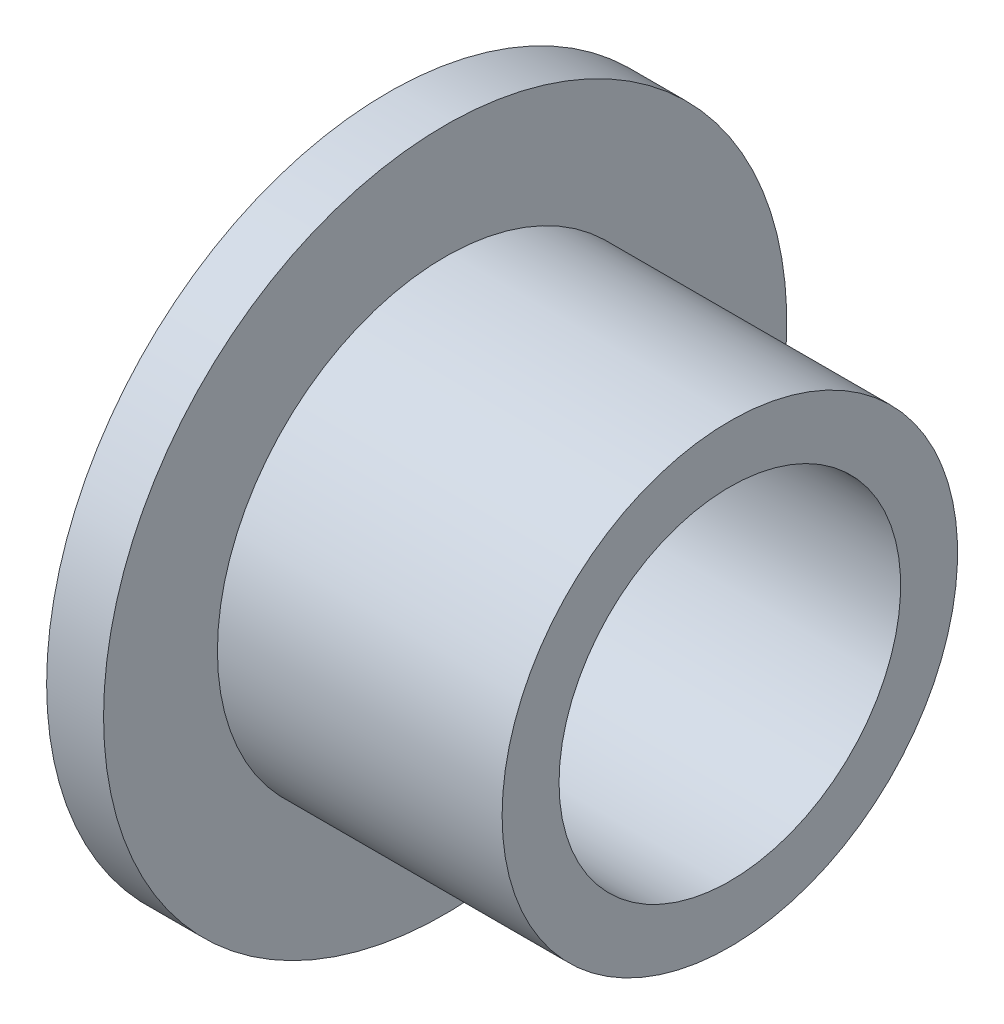
ISO-10303-21;
HEADER;
FILE_DESCRIPTION(('STEP AP214'),'2;1');
FILE_NAME('part.step','',(''),(''),'','','');
FILE_SCHEMA(('AUTOMOTIVE_DESIGN { 1 0 10303 214 1 1 1 1 }'));
ENDSEC;
DATA;
#1=APPLICATION_CONTEXT('core data for automotive mechanical design processes');
#2=APPLICATION_PROTOCOL_DEFINITION('international standard','automotive_design',2000,#1);
#3=PRODUCT_CONTEXT('',#1,'mechanical');
#4=PRODUCT('Part','Part','',(#3));
#5=PRODUCT_RELATED_PRODUCT_CATEGORY('part','',(#4));
#6=PRODUCT_DEFINITION_FORMATION('','',#4);
#7=PRODUCT_DEFINITION_CONTEXT('part definition',#1,'design');
#8=PRODUCT_DEFINITION('design','',#6,#7);
#9=PRODUCT_DEFINITION_SHAPE('','',#8);
#10=(LENGTH_UNIT() NAMED_UNIT(*) SI_UNIT(.MILLI.,.METRE.));
#11=(NAMED_UNIT(*) PLANE_ANGLE_UNIT() SI_UNIT($,.RADIAN.));
#12=(NAMED_UNIT(*) SI_UNIT($,.STERADIAN.) SOLID_ANGLE_UNIT());
#13=UNCERTAINTY_MEASURE_WITH_UNIT(LENGTH_MEASURE(1.E-05),#10,'distance_accuracy_value','');
#14=(GEOMETRIC_REPRESENTATION_CONTEXT(3) GLOBAL_UNCERTAINTY_ASSIGNED_CONTEXT((#13)) GLOBAL_UNIT_ASSIGNED_CONTEXT((#10,
#11,#12)) REPRESENTATION_CONTEXT('',''));
#15=CARTESIAN_POINT('',(0.,0.,0.));
#16=DIRECTION('',(0.,0.,1.));
#17=DIRECTION('',(1.,0.,0.));
#18=AXIS2_PLACEMENT_3D('',#15,#16,#17);
#19=CARTESIAN_POINT('',(0.,0.,0.));
#20=DIRECTION('',(-1.,0.,0.));
#21=DIRECTION('',(0.,0.,1.));
#22=AXIS2_PLACEMENT_3D('',#19,#20,#21);
#23=CYLINDRICAL_SURFACE('',#22,3.);
#24=CARTESIAN_POINT('',(6.,0.,0.));
#25=DIRECTION('',(-1.,0.,0.));
#26=DIRECTION('',(0.,0.,1.));
#27=AXIS2_PLACEMENT_3D('',#24,#25,#26);
#28=CIRCLE('',#27,3.);
#29=CARTESIAN_POINT('',(6.,0.,3.));
#30=VERTEX_POINT('',#29);
#31=EDGE_CURVE('E54',#30,#30,#28,.T.);
#32=ORIENTED_EDGE('',*,*,#31,.F.);
#33=EDGE_LOOP('',(#32));
#34=FACE_BOUND('',#33,.T.);
#35=CARTESIAN_POINT('',(0.,0.,0.));
#36=DIRECTION('',(-1.,0.,0.));
#37=DIRECTION('',(0.,0.,1.));
#38=AXIS2_PLACEMENT_3D('',#35,#36,#37);
#39=CIRCLE('',#38,3.);
#40=CARTESIAN_POINT('',(0.,0.,3.));
#41=VERTEX_POINT('',#40);
#42=EDGE_CURVE('E10',#41,#41,#39,.T.);
#43=ORIENTED_EDGE('',*,*,#42,.T.);
#44=EDGE_LOOP('',(#43));
#45=FACE_BOUND('',#44,.T.);
#46=ADVANCED_FACE('F32',(#34,#45),#23,.F.);
#47=CARTESIAN_POINT('',(0.,6.,0.));
#48=DIRECTION('',(1.,0.,0.));
#49=DIRECTION('',(0.,0.,-1.));
#50=AXIS2_PLACEMENT_3D('',#47,#48,#49);
#51=PLANE('',#50);
#52=ORIENTED_EDGE('',*,*,#42,.F.);
#53=EDGE_LOOP('',(#52));
#54=FACE_BOUND('',#53,.T.);
#55=CARTESIAN_POINT('',(0.,0.,0.));
#56=DIRECTION('',(-1.,0.,0.));
#57=DIRECTION('',(0.,0.,1.));
#58=AXIS2_PLACEMENT_3D('',#55,#56,#57);
#59=CIRCLE('',#58,6.);
#60=CARTESIAN_POINT('',(0.,0.,6.));
#61=VERTEX_POINT('',#60);
#62=EDGE_CURVE('E38',#61,#61,#59,.T.);
#63=ORIENTED_EDGE('',*,*,#62,.T.);
#64=EDGE_LOOP('',(#63));
#65=FACE_BOUND('',#64,.T.);
#66=ADVANCED_FACE('F62',(#54,#65),#51,.F.);
#67=CARTESIAN_POINT('',(0.,0.,0.));
#68=DIRECTION('',(-1.,0.,0.));
#69=DIRECTION('',(0.,0.,1.));
#70=AXIS2_PLACEMENT_3D('',#67,#68,#69);
#71=CYLINDRICAL_SURFACE('',#70,6.);
#72=CARTESIAN_POINT('',(1.,0.,0.));
#73=DIRECTION('',(-1.,0.,0.));
#74=DIRECTION('',(0.,0.,1.));
#75=AXIS2_PLACEMENT_3D('',#72,#73,#74);
#76=CIRCLE('',#75,6.);
#77=CARTESIAN_POINT('',(1.,0.,6.));
#78=VERTEX_POINT('',#77);
#79=EDGE_CURVE('E42',#78,#78,#76,.T.);
#80=ORIENTED_EDGE('',*,*,#79,.T.);
#81=EDGE_LOOP('',(#80));
#82=FACE_BOUND('',#81,.T.);
#83=ORIENTED_EDGE('',*,*,#62,.F.);
#84=EDGE_LOOP('',(#83));
#85=FACE_BOUND('',#84,.T.);
#86=ADVANCED_FACE('F66',(#82,#85),#71,.T.);
#87=CARTESIAN_POINT('',(1.,6.,0.));
#88=DIRECTION('',(1.,0.,0.));
#89=DIRECTION('',(0.,0.,-1.));
#90=AXIS2_PLACEMENT_3D('',#87,#88,#89);
#91=PLANE('',#90);
#92=CARTESIAN_POINT('',(1.,0.,0.));
#93=DIRECTION('',(-1.,0.,0.));
#94=DIRECTION('',(0.,0.,1.));
#95=AXIS2_PLACEMENT_3D('',#92,#93,#94);
#96=CIRCLE('',#95,4.);
#97=CARTESIAN_POINT('',(1.,0.,4.));
#98=VERTEX_POINT('',#97);
#99=EDGE_CURVE('E46',#98,#98,#96,.T.);
#100=ORIENTED_EDGE('',*,*,#99,.T.);
#101=EDGE_LOOP('',(#100));
#102=FACE_BOUND('',#101,.T.);
#103=ORIENTED_EDGE('',*,*,#79,.F.);
#104=EDGE_LOOP('',(#103));
#105=FACE_BOUND('',#104,.T.);
#106=ADVANCED_FACE('F71',(#102,#105),#91,.T.);
#107=CARTESIAN_POINT('',(0.,0.,0.));
#108=DIRECTION('',(-1.,0.,0.));
#109=DIRECTION('',(0.,0.,1.));
#110=AXIS2_PLACEMENT_3D('',#107,#108,#109);
#111=CYLINDRICAL_SURFACE('',#110,4.);
#112=CARTESIAN_POINT('',(6.,0.,0.));
#113=DIRECTION('',(-1.,0.,0.));
#114=DIRECTION('',(0.,0.,1.));
#115=AXIS2_PLACEMENT_3D('',#112,#113,#114);
#116=CIRCLE('',#115,4.);
#117=CARTESIAN_POINT('',(6.,0.,4.));
#118=VERTEX_POINT('',#117);
#119=EDGE_CURVE('E51',#118,#118,#116,.T.);
#120=ORIENTED_EDGE('',*,*,#119,.T.);
#121=EDGE_LOOP('',(#120));
#122=FACE_BOUND('',#121,.T.);
#123=ORIENTED_EDGE('',*,*,#99,.F.);
#124=EDGE_LOOP('',(#123));
#125=FACE_BOUND('',#124,.T.);
#126=ADVANCED_FACE('F77',(#122,#125),#111,.T.);
#127=CARTESIAN_POINT('',(6.,4.,0.));
#128=DIRECTION('',(1.,0.,0.));
#129=DIRECTION('',(0.,0.,-1.));
#130=AXIS2_PLACEMENT_3D('',#127,#128,#129);
#131=PLANE('',#130);
#132=ORIENTED_EDGE('',*,*,#31,.T.);
#133=EDGE_LOOP('',(#132));
#134=FACE_BOUND('',#133,.T.);
#135=ORIENTED_EDGE('',*,*,#119,.F.);
#136=EDGE_LOOP('',(#135));
#137=FACE_BOUND('',#136,.T.);
#138=ADVANCED_FACE('F58',(#134,#137),#131,.T.);
#139=CLOSED_SHELL('',(#46,#66,#86,#106,#126,#138));
#140=MANIFOLD_SOLID_BREP('B2',#139);
#141=ADVANCED_BREP_SHAPE_REPRESENTATION('',(#18,#140),#14);
#142=SHAPE_DEFINITION_REPRESENTATION(#9,#141);
ENDSEC;
END-ISO-10303-21;
